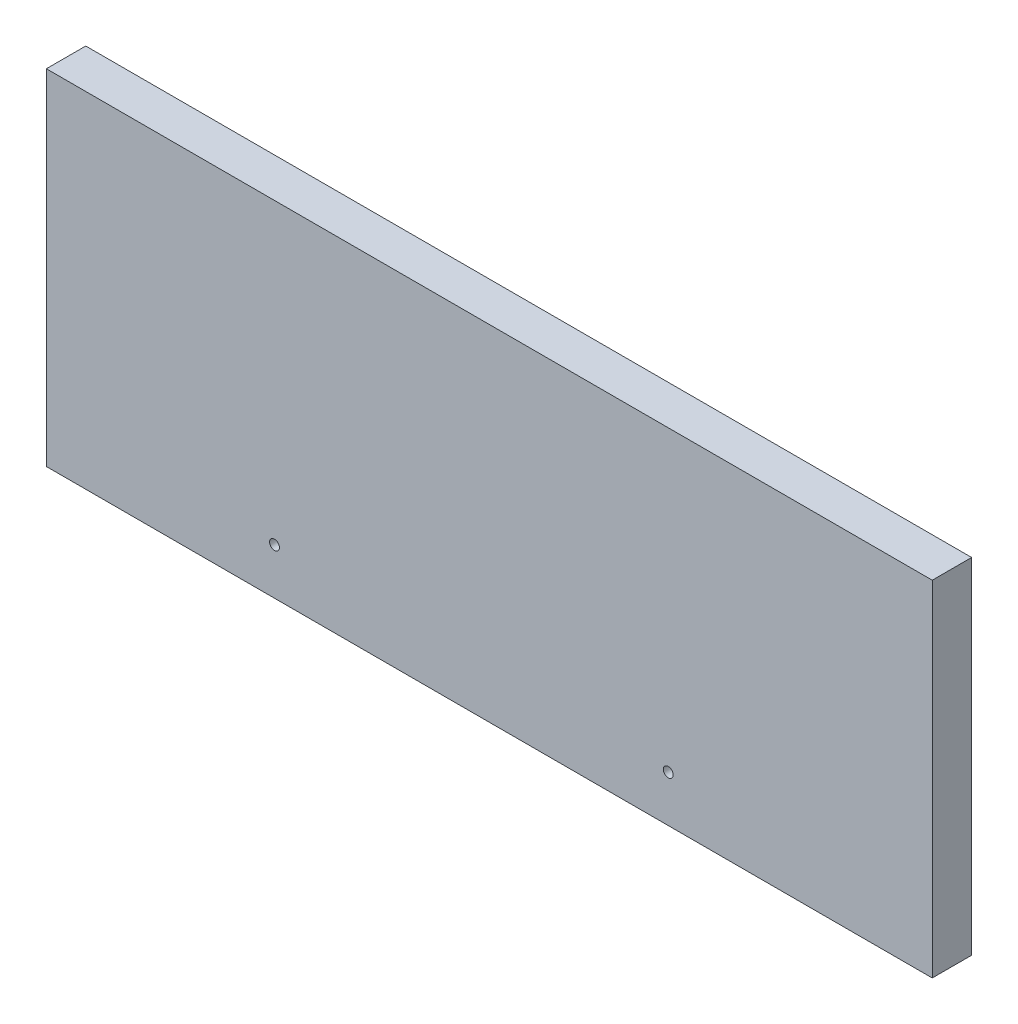
ISO-10303-21;
HEADER;
FILE_DESCRIPTION(('STEP AP214'),'2;1');
FILE_NAME('part.step','',(''),(''),'','','');
FILE_SCHEMA(('AUTOMOTIVE_DESIGN { 1 0 10303 214 1 1 1 1 }'));
ENDSEC;
DATA;
#1=APPLICATION_CONTEXT('core data for automotive mechanical design processes');
#2=APPLICATION_PROTOCOL_DEFINITION('international standard','automotive_design',2000,#1);
#3=PRODUCT_CONTEXT('',#1,'mechanical');
#4=PRODUCT('Part','Part','',(#3));
#5=PRODUCT_RELATED_PRODUCT_CATEGORY('part','',(#4));
#6=PRODUCT_DEFINITION_FORMATION('','',#4);
#7=PRODUCT_DEFINITION_CONTEXT('part definition',#1,'design');
#8=PRODUCT_DEFINITION('design','',#6,#7);
#9=PRODUCT_DEFINITION_SHAPE('','',#8);
#10=(LENGTH_UNIT() NAMED_UNIT(*) SI_UNIT(.MILLI.,.METRE.));
#11=(NAMED_UNIT(*) PLANE_ANGLE_UNIT() SI_UNIT($,.RADIAN.));
#12=(NAMED_UNIT(*) SI_UNIT($,.STERADIAN.) SOLID_ANGLE_UNIT());
#13=UNCERTAINTY_MEASURE_WITH_UNIT(LENGTH_MEASURE(1.E-05),#10,'distance_accuracy_value','');
#14=(GEOMETRIC_REPRESENTATION_CONTEXT(3) GLOBAL_UNCERTAINTY_ASSIGNED_CONTEXT((#13)) GLOBAL_UNIT_ASSIGNED_CONTEXT((#10,
#11,#12)) REPRESENTATION_CONTEXT('',''));
#15=CARTESIAN_POINT('',(0.,0.,0.));
#16=DIRECTION('',(0.,0.,1.));
#17=DIRECTION('',(1.,0.,0.));
#18=AXIS2_PLACEMENT_3D('',#15,#16,#17);
#19=CARTESIAN_POINT('',(225.,-87.5,20.));
#20=DIRECTION('',(-1.,0.,0.));
#21=DIRECTION('',(0.,0.,1.));
#22=AXIS2_PLACEMENT_3D('',#19,#20,#21);
#23=PLANE('',#22);
#24=DIRECTION('',(0.,1.,0.));
#25=VECTOR('',#24,1.);
#26=CARTESIAN_POINT('',(225.,-87.5,0.));
#27=LINE('',#26,#25);
#28=CARTESIAN_POINT('',(225.,-87.5,0.));
#29=VERTEX_POINT('',#28);
#30=CARTESIAN_POINT('',(225.,87.5,0.));
#31=VERTEX_POINT('',#30);
#32=EDGE_CURVE('E97',#29,#31,#27,.T.);
#33=ORIENTED_EDGE('',*,*,#32,.T.);
#34=DIRECTION('',(0.,0.,-1.));
#35=VECTOR('',#34,1.);
#36=CARTESIAN_POINT('',(225.,87.5,20.));
#37=LINE('',#36,#35);
#38=CARTESIAN_POINT('',(225.,87.5,20.));
#39=VERTEX_POINT('',#38);
#40=EDGE_CURVE('E11',#39,#31,#37,.T.);
#41=ORIENTED_EDGE('',*,*,#40,.F.);
#42=DIRECTION('',(0.,1.,0.));
#43=VECTOR('',#42,1.);
#44=CARTESIAN_POINT('',(225.,-87.5,20.));
#45=LINE('',#44,#43);
#46=CARTESIAN_POINT('',(225.,-87.5,20.));
#47=VERTEX_POINT('',#46);
#48=EDGE_CURVE('E85',#47,#39,#45,.T.);
#49=ORIENTED_EDGE('',*,*,#48,.F.);
#50=DIRECTION('',(0.,0.,-1.));
#51=VECTOR('',#50,1.);
#52=CARTESIAN_POINT('',(225.,-87.5,20.));
#53=LINE('',#52,#51);
#54=EDGE_CURVE('E93',#47,#29,#53,.T.);
#55=ORIENTED_EDGE('',*,*,#54,.T.);
#56=EDGE_LOOP('',(#33,#41,#49,#55));
#57=FACE_BOUND('',#56,.T.);
#58=ADVANCED_FACE('F34',(#57),#23,.F.);
#59=CARTESIAN_POINT('',(-225.,87.5,20.));
#60=DIRECTION('',(0.,-1.,0.));
#61=DIRECTION('',(0.,0.,-1.));
#62=AXIS2_PLACEMENT_3D('',#59,#60,#61);
#63=PLANE('',#62);
#64=DIRECTION('',(-1.,0.,0.));
#65=VECTOR('',#64,1.);
#66=CARTESIAN_POINT('',(-225.,87.5,0.));
#67=LINE('',#66,#65);
#68=CARTESIAN_POINT('',(-225.,87.5,0.));
#69=VERTEX_POINT('',#68);
#70=EDGE_CURVE('E89',#31,#69,#67,.T.);
#71=ORIENTED_EDGE('',*,*,#70,.T.);
#72=DIRECTION('',(0.,0.,-1.));
#73=VECTOR('',#72,1.);
#74=CARTESIAN_POINT('',(-225.,87.5,20.));
#75=LINE('',#74,#73);
#76=CARTESIAN_POINT('',(-225.,87.5,20.));
#77=VERTEX_POINT('',#76);
#78=EDGE_CURVE('E42',#77,#69,#75,.T.);
#79=ORIENTED_EDGE('',*,*,#78,.F.);
#80=DIRECTION('',(-1.,0.,0.));
#81=VECTOR('',#80,1.);
#82=CARTESIAN_POINT('',(-225.,87.5,20.));
#83=LINE('',#82,#81);
#84=EDGE_CURVE('E80',#39,#77,#83,.T.);
#85=ORIENTED_EDGE('',*,*,#84,.F.);
#86=ORIENTED_EDGE('',*,*,#40,.T.);
#87=EDGE_LOOP('',(#71,#79,#85,#86));
#88=FACE_BOUND('',#87,.T.);
#89=ADVANCED_FACE('F88',(#88),#63,.F.);
#90=CARTESIAN_POINT('',(-225.,-87.5,20.));
#91=DIRECTION('',(1.,0.,0.));
#92=DIRECTION('',(0.,0.,-1.));
#93=AXIS2_PLACEMENT_3D('',#90,#91,#92);
#94=PLANE('',#93);
#95=DIRECTION('',(0.,-1.,0.));
#96=VECTOR('',#95,1.);
#97=CARTESIAN_POINT('',(-225.,-87.5,0.));
#98=LINE('',#97,#96);
#99=CARTESIAN_POINT('',(-225.,-87.5,0.));
#100=VERTEX_POINT('',#99);
#101=EDGE_CURVE('E67',#69,#100,#98,.T.);
#102=ORIENTED_EDGE('',*,*,#101,.T.);
#103=DIRECTION('',(0.,0.,-1.));
#104=VECTOR('',#103,1.);
#105=CARTESIAN_POINT('',(-225.,-87.5,20.));
#106=LINE('',#105,#104);
#107=CARTESIAN_POINT('',(-225.,-87.5,20.));
#108=VERTEX_POINT('',#107);
#109=EDGE_CURVE('E90',#108,#100,#106,.T.);
#110=ORIENTED_EDGE('',*,*,#109,.F.);
#111=DIRECTION('',(0.,-1.,0.));
#112=VECTOR('',#111,1.);
#113=CARTESIAN_POINT('',(-225.,-87.5,20.));
#114=LINE('',#113,#112);
#115=EDGE_CURVE('E83',#77,#108,#114,.T.);
#116=ORIENTED_EDGE('',*,*,#115,.F.);
#117=ORIENTED_EDGE('',*,*,#78,.T.);
#118=EDGE_LOOP('',(#102,#110,#116,#117));
#119=FACE_BOUND('',#118,.T.);
#120=ADVANCED_FACE('F91',(#119),#94,.F.);
#121=CARTESIAN_POINT('',(-225.,-87.5,20.));
#122=DIRECTION('',(0.,1.,0.));
#123=DIRECTION('',(0.,0.,1.));
#124=AXIS2_PLACEMENT_3D('',#121,#122,#123);
#125=PLANE('',#124);
#126=DIRECTION('',(1.,0.,0.));
#127=VECTOR('',#126,1.);
#128=CARTESIAN_POINT('',(-225.,-87.5,0.));
#129=LINE('',#128,#127);
#130=EDGE_CURVE('E73',#100,#29,#129,.T.);
#131=ORIENTED_EDGE('',*,*,#130,.T.);
#132=ORIENTED_EDGE('',*,*,#54,.F.);
#133=DIRECTION('',(1.,0.,0.));
#134=VECTOR('',#133,1.);
#135=CARTESIAN_POINT('',(-225.,-87.5,20.));
#136=LINE('',#135,#134);
#137=EDGE_CURVE('E50',#108,#47,#136,.T.);
#138=ORIENTED_EDGE('',*,*,#137,.F.);
#139=ORIENTED_EDGE('',*,*,#109,.T.);
#140=EDGE_LOOP('',(#131,#132,#138,#139));
#141=FACE_BOUND('',#140,.T.);
#142=ADVANCED_FACE('F105',(#141),#125,.F.);
#143=CARTESIAN_POINT('',(0.,0.,20.));
#144=DIRECTION('',(0.,0.,-1.));
#145=DIRECTION('',(-1.,0.,0.));
#146=AXIS2_PLACEMENT_3D('',#143,#144,#145);
#147=PLANE('',#146);
#148=CARTESIAN_POINT('',(-109.12,-64.,20.));
#149=DIRECTION('',(0.,0.,1.));
#150=DIRECTION('',(1.,0.,0.));
#151=AXIS2_PLACEMENT_3D('',#148,#149,#150);
#152=CIRCLE('',#151,2.50000000000001);
#153=CARTESIAN_POINT('',(-106.62,-64.,20.));
#154=VERTEX_POINT('',#153);
#155=EDGE_CURVE('E117',#154,#154,#152,.T.);
#156=ORIENTED_EDGE('',*,*,#155,.F.);
#157=EDGE_LOOP('',(#156));
#158=FACE_BOUND('',#157,.T.);
#159=CARTESIAN_POINT('',(90.8800000000001,-64.,20.));
#160=DIRECTION('',(0.,0.,1.));
#161=DIRECTION('',(1.,0.,0.));
#162=AXIS2_PLACEMENT_3D('',#159,#160,#161);
#163=CIRCLE('',#162,2.5);
#164=CARTESIAN_POINT('',(93.3800000000001,-64.,20.));
#165=VERTEX_POINT('',#164);
#166=EDGE_CURVE('E111',#165,#165,#163,.T.);
#167=ORIENTED_EDGE('',*,*,#166,.F.);
#168=EDGE_LOOP('',(#167));
#169=FACE_BOUND('',#168,.T.);
#170=ORIENTED_EDGE('',*,*,#48,.T.);
#171=ORIENTED_EDGE('',*,*,#84,.T.);
#172=ORIENTED_EDGE('',*,*,#115,.T.);
#173=ORIENTED_EDGE('',*,*,#137,.T.);
#174=EDGE_LOOP('',(#170,#171,#172,#173));
#175=FACE_BOUND('',#174,.T.);
#176=ADVANCED_FACE('F81',(#158,#169,#175),#147,.F.);
#177=CARTESIAN_POINT('',(0.,0.,0.));
#178=DIRECTION('',(0.,0.,-1.));
#179=DIRECTION('',(-1.,0.,0.));
#180=AXIS2_PLACEMENT_3D('',#177,#178,#179);
#181=PLANE('',#180);
#182=CARTESIAN_POINT('',(-109.12,-64.,0.));
#183=DIRECTION('',(0.,0.,1.));
#184=DIRECTION('',(1.,0.,0.));
#185=AXIS2_PLACEMENT_3D('',#182,#183,#184);
#186=CIRCLE('',#185,2.50000000000001);
#187=CARTESIAN_POINT('',(-106.62,-64.,0.));
#188=VERTEX_POINT('',#187);
#189=EDGE_CURVE('E100',#188,#188,#186,.T.);
#190=ORIENTED_EDGE('',*,*,#189,.T.);
#191=EDGE_LOOP('',(#190));
#192=FACE_BOUND('',#191,.T.);
#193=CARTESIAN_POINT('',(90.8800000000001,-64.,0.));
#194=DIRECTION('',(0.,0.,1.));
#195=DIRECTION('',(1.,0.,0.));
#196=AXIS2_PLACEMENT_3D('',#193,#194,#195);
#197=CIRCLE('',#196,2.5);
#198=CARTESIAN_POINT('',(93.3800000000001,-64.,0.));
#199=VERTEX_POINT('',#198);
#200=EDGE_CURVE('E114',#199,#199,#197,.T.);
#201=ORIENTED_EDGE('',*,*,#200,.T.);
#202=EDGE_LOOP('',(#201));
#203=FACE_BOUND('',#202,.T.);
#204=ORIENTED_EDGE('',*,*,#32,.F.);
#205=ORIENTED_EDGE('',*,*,#130,.F.);
#206=ORIENTED_EDGE('',*,*,#101,.F.);
#207=ORIENTED_EDGE('',*,*,#70,.F.);
#208=EDGE_LOOP('',(#204,#205,#206,#207));
#209=FACE_BOUND('',#208,.T.);
#210=ADVANCED_FACE('F108',(#192,#203,#209),#181,.T.);
#211=CARTESIAN_POINT('',(90.8800000000001,-64.,0.));
#212=DIRECTION('',(0.,0.,1.));
#213=DIRECTION('',(1.,0.,0.));
#214=AXIS2_PLACEMENT_3D('',#211,#212,#213);
#215=CYLINDRICAL_SURFACE('',#214,2.5);
#216=ORIENTED_EDGE('',*,*,#200,.F.);
#217=EDGE_LOOP('',(#216));
#218=FACE_BOUND('',#217,.T.);
#219=ORIENTED_EDGE('',*,*,#166,.T.);
#220=EDGE_LOOP('',(#219));
#221=FACE_BOUND('',#220,.T.);
#222=ADVANCED_FACE('F128',(#218,#221),#215,.F.);
#223=CARTESIAN_POINT('',(-109.12,-64.,0.));
#224=DIRECTION('',(0.,0.,1.));
#225=DIRECTION('',(1.,0.,0.));
#226=AXIS2_PLACEMENT_3D('',#223,#224,#225);
#227=CYLINDRICAL_SURFACE('',#226,2.50000000000001);
#228=ORIENTED_EDGE('',*,*,#189,.F.);
#229=EDGE_LOOP('',(#228));
#230=FACE_BOUND('',#229,.T.);
#231=ORIENTED_EDGE('',*,*,#155,.T.);
#232=EDGE_LOOP('',(#231));
#233=FACE_BOUND('',#232,.T.);
#234=ADVANCED_FACE('F125',(#230,#233),#227,.F.);
#235=CLOSED_SHELL('',(#58,#89,#120,#142,#176,#210,#222,#234));
#236=MANIFOLD_SOLID_BREP('B2',#235);
#237=ADVANCED_BREP_SHAPE_REPRESENTATION('',(#18,#236),#14);
#238=SHAPE_DEFINITION_REPRESENTATION(#9,#237);
ENDSEC;
END-ISO-10303-21;
